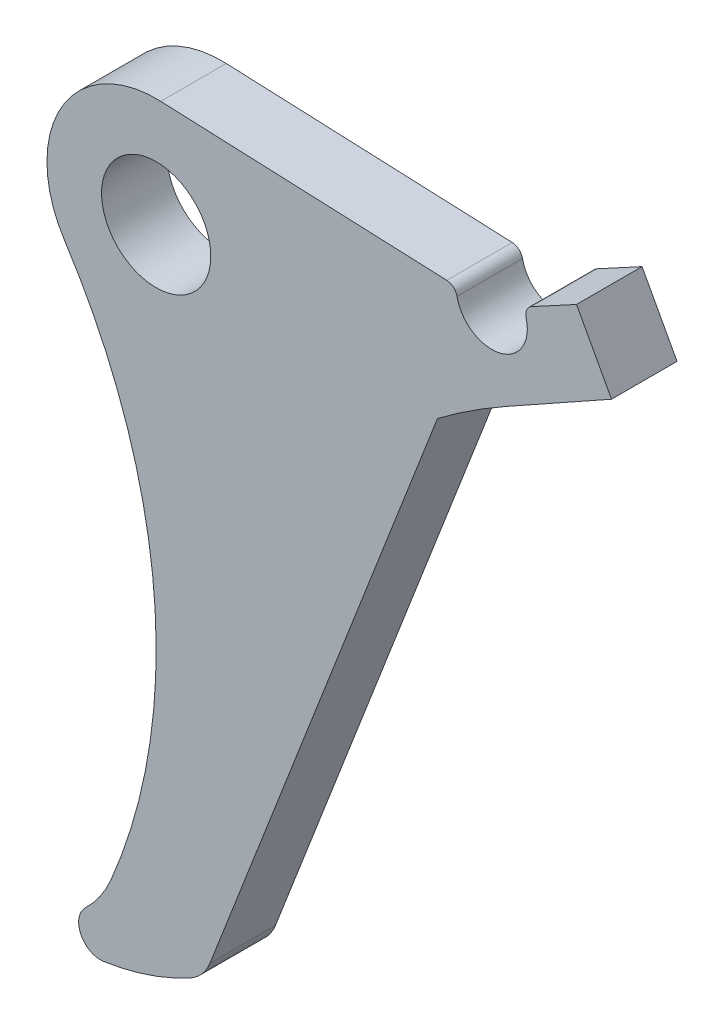
ISO-10303-21;
HEADER;
FILE_DESCRIPTION(('STEP AP214'),'2;1');
FILE_NAME('part.step','',(''),(''),'','','');
FILE_SCHEMA(('AUTOMOTIVE_DESIGN { 1 0 10303 214 1 1 1 1 }'));
ENDSEC;
DATA;
#1=APPLICATION_CONTEXT('core data for automotive mechanical design processes');
#2=APPLICATION_PROTOCOL_DEFINITION('international standard','automotive_design',2000,#1);
#3=PRODUCT_CONTEXT('',#1,'mechanical');
#4=PRODUCT('Part','Part','',(#3));
#5=PRODUCT_RELATED_PRODUCT_CATEGORY('part','',(#4));
#6=PRODUCT_DEFINITION_FORMATION('','',#4);
#7=PRODUCT_DEFINITION_CONTEXT('part definition',#1,'design');
#8=PRODUCT_DEFINITION('design','',#6,#7);
#9=PRODUCT_DEFINITION_SHAPE('','',#8);
#10=(LENGTH_UNIT() NAMED_UNIT(*) SI_UNIT(.MILLI.,.METRE.));
#11=(NAMED_UNIT(*) PLANE_ANGLE_UNIT() SI_UNIT($,.RADIAN.));
#12=(NAMED_UNIT(*) SI_UNIT($,.STERADIAN.) SOLID_ANGLE_UNIT());
#13=UNCERTAINTY_MEASURE_WITH_UNIT(LENGTH_MEASURE(1.E-05),#10,'distance_accuracy_value','');
#14=(GEOMETRIC_REPRESENTATION_CONTEXT(3) GLOBAL_UNCERTAINTY_ASSIGNED_CONTEXT((#13)) GLOBAL_UNIT_ASSIGNED_CONTEXT((#10,
#11,#12)) REPRESENTATION_CONTEXT('',''));
#15=CARTESIAN_POINT('',(0.,0.,0.));
#16=DIRECTION('',(0.,0.,1.));
#17=DIRECTION('',(1.,0.,0.));
#18=AXIS2_PLACEMENT_3D('',#15,#16,#17);
#19=CARTESIAN_POINT('',(-5.09997800634963,-58.8502306487025,3.));
#20=DIRECTION('',(0.,0.,1.));
#21=DIRECTION('',(1.,0.,0.));
#22=AXIS2_PLACEMENT_3D('',#19,#20,#21);
#23=PLANE('',#22);
#24=CARTESIAN_POINT('',(-5.09997800634963,-58.8502306487025,3.));
#25=DIRECTION('',(0.,0.,1.));
#26=DIRECTION('',(1.,0.,0.));
#27=AXIS2_PLACEMENT_3D('',#24,#25,#26);
#28=CIRCLE('',#27,2.);
#29=CARTESIAN_POINT('',(-6.47627281252223,-57.399088820175,3.));
#30=VERTEX_POINT('',#29);
#31=CARTESIAN_POINT('',(-4.8061098376504,-60.8285232204485,3.));
#32=VERTEX_POINT('',#31);
#33=EDGE_CURVE('E224',#30,#32,#28,.T.);
#34=ORIENTED_EDGE('',*,*,#33,.T.);
#35=CARTESIAN_POINT('',(-8.31922159690975,-37.1785888712499,3.));
#36=DIRECTION('',(0.,0.,1.));
#37=DIRECTION('',(1.,0.,0.));
#38=AXIS2_PLACEMENT_3D('',#35,#36,#37);
#39=CIRCLE('',#38,23.9094405822146);
#40=CARTESIAN_POINT('',(3.09796295264736,-58.1859505788943,3.));
#41=VERTEX_POINT('',#40);
#42=EDGE_CURVE('E119',#32,#41,#39,.T.);
#43=ORIENTED_EDGE('',*,*,#42,.T.);
#44=CARTESIAN_POINT('',(1.18789157137882,-54.6714623773977,3.));
#45=DIRECTION('',(0.,0.,1.));
#46=DIRECTION('',(1.,0.,0.));
#47=AXIS2_PLACEMENT_3D('',#44,#45,#46);
#48=CIRCLE('',#47,4.00000000000001);
#49=CARTESIAN_POINT('',(4.91623441296361,-56.1204136034932,3.));
#50=VERTEX_POINT('',#49);
#51=EDGE_CURVE('E219',#41,#50,#48,.T.);
#52=ORIENTED_EDGE('',*,*,#51,.T.);
#53=DIRECTION('',(0.362237806523864,0.932085710396195,0.));
#54=VECTOR('',#53,1.);
#55=CARTESIAN_POINT('',(4.91623441296361,-56.1204136034932,3.));
#56=LINE('',#55,#54);
#57=CARTESIAN_POINT('',(25.7600480741137,-2.48652858702379,3.));
#58=VERTEX_POINT('',#57);
#59=EDGE_CURVE('E217',#50,#58,#56,.T.);
#60=ORIENTED_EDGE('',*,*,#59,.T.);
#61=CARTESIAN_POINT('',(58.6903833292251,-46.1515151172352,3.));
#62=DIRECTION('',(0.,0.,-1.));
#63=DIRECTION('',(1.,0.,0.));
#64=AXIS2_PLACEMENT_3D('',#61,#62,#63);
#65=CIRCLE('',#64,54.6903833292251);
#66=CARTESIAN_POINT('',(31.9920212548681,1.57935006708883,3.));
#67=VERTEX_POINT('',#66);
#68=EDGE_CURVE('E209',#58,#67,#65,.T.);
#69=ORIENTED_EDGE('',*,*,#68,.T.);
#70=DIRECTION('',(0.872746948892164,0.488172882490843,0.));
#71=VECTOR('',#70,1.);
#72=CARTESIAN_POINT('',(31.9920212548681,1.57935006708883,3.));
#73=LINE('',#72,#71);
#74=CARTESIAN_POINT('',(41.6932201112617,7.00573650745857,3.));
#75=VERTEX_POINT('',#74);
#76=EDGE_CURVE('E206',#67,#75,#73,.T.);
#77=ORIENTED_EDGE('',*,*,#76,.T.);
#78=DIRECTION('',(-0.476238263001309,0.879316278055568,0.));
#79=VECTOR('',#78,1.);
#80=CARTESIAN_POINT('',(41.6932201112617,7.00573650745857,3.));
#81=LINE('',#80,#79);
#82=CARTESIAN_POINT('',(38.4898873605694,12.9203024937377,3.));
#83=VERTEX_POINT('',#82);
#84=EDGE_CURVE('E203',#75,#83,#81,.T.);
#85=ORIENTED_EDGE('',*,*,#84,.T.);
#86=DIRECTION('',(-0.879316278055567,-0.47623826300131,0.));
#87=VECTOR('',#86,1.);
#88=CARTESIAN_POINT('',(38.4898873605694,12.9203024937377,3.));
#89=LINE('',#88,#87);
#90=CARTESIAN_POINT('',(34.365244292859,10.6863931495249,3.));
#91=VERTEX_POINT('',#90);
#92=EDGE_CURVE('E201',#83,#91,#89,.T.);
#93=ORIENTED_EDGE('',*,*,#92,.T.);
#94=CARTESIAN_POINT('',(34.8414825558603,9.8070768714693,3.));
#95=DIRECTION('',(0.,0.,1.));
#96=DIRECTION('',(1.,0.,0.));
#97=AXIS2_PLACEMENT_3D('',#94,#95,#96);
#98=CIRCLE('',#97,1.);
#99=CARTESIAN_POINT('',(33.8747977113715,9.55110731969473,3.));
#100=VERTEX_POINT('',#99);
#101=EDGE_CURVE('E193',#91,#100,#98,.T.);
#102=ORIENTED_EDGE('',*,*,#101,.T.);
#103=CARTESIAN_POINT('',(30.7330719667829,8.71920627642735,3.));
#104=DIRECTION('',(0.,0.,-1.));
#105=DIRECTION('',(1.,0.,0.));
#106=AXIS2_PLACEMENT_3D('',#103,#104,#105);
#107=CIRCLE('',#106,3.25);
#108=CARTESIAN_POINT('',(27.5450357775952,8.08760097528636,3.));
#109=VERTEX_POINT('',#108);
#110=EDGE_CURVE('E190',#100,#109,#107,.T.);
#111=ORIENTED_EDGE('',*,*,#110,.T.);
#112=CARTESIAN_POINT('',(26.5641015655374,7.8932608826276,3.));
#113=DIRECTION('',(0.,0.,1.));
#114=DIRECTION('',(1.,0.,0.));
#115=AXIS2_PLACEMENT_3D('',#112,#113,#114);
#116=CIRCLE('',#115,0.999999999999997);
#117=CARTESIAN_POINT('',(26.6060257735832,8.89238167651576,3.));
#118=VERTEX_POINT('',#117);
#119=EDGE_CURVE('E187',#109,#118,#116,.T.);
#120=ORIENTED_EDGE('',*,*,#119,.T.);
#121=DIRECTION('',(-0.999120793888174,0.0419242080457737,0.));
#122=VECTOR('',#121,1.);
#123=CARTESIAN_POINT('',(0.419242080457745,9.99120793888174,3.));
#124=LINE('',#123,#122);
#125=CARTESIAN_POINT('',(0.419242080457738,9.99120793888173,3.));
#126=VERTEX_POINT('',#125);
#127=EDGE_CURVE('E159',#118,#126,#124,.T.);
#128=ORIENTED_EDGE('',*,*,#127,.T.);
#129=CARTESIAN_POINT('',(0.,0.,3.));
#130=DIRECTION('',(0.,0.,1.));
#131=DIRECTION('',(1.,0.,0.));
#132=AXIS2_PLACEMENT_3D('',#129,#130,#131);
#133=CIRCLE('',#132,9.99999999999999);
#134=CARTESIAN_POINT('',(-8.38314883928712,-5.45186349227113,3.));
#135=VERTEX_POINT('',#134);
#136=EDGE_CURVE('E153',#126,#135,#133,.T.);
#137=ORIENTED_EDGE('',*,*,#136,.T.);
#138=CARTESIAN_POINT('',(-51.84861193773,-33.7190189470957,3.));
#139=DIRECTION('',(0.,0.,-1.));
#140=DIRECTION('',(1.,0.,0.));
#141=AXIS2_PLACEMENT_3D('',#138,#139,#140);
#142=CIRCLE('',#141,51.84861193773);
#143=CARTESIAN_POINT('',(-4.16010245039586,-54.0680882807473,3.));
#144=VERTEX_POINT('',#143);
#145=EDGE_CURVE('E157',#135,#144,#142,.T.);
#146=ORIENTED_EDGE('',*,*,#145,.T.);
#147=CARTESIAN_POINT('',(-13.3577468433852,-50.1433796775371,3.));
#148=DIRECTION('',(0.,0.,-1.));
#149=DIRECTION('',(1.,0.,0.));
#150=AXIS2_PLACEMENT_3D('',#147,#148,#149);
#151=CIRCLE('',#150,10.);
#152=EDGE_CURVE('E55',#144,#30,#151,.T.);
#153=ORIENTED_EDGE('',*,*,#152,.T.);
#154=EDGE_LOOP('',(#34,#43,#52,#60,#69,#77,#85,#93,#102,#111,#120,#128,#137,#146,#153));
#155=FACE_BOUND('',#154,.T.);
#156=CARTESIAN_POINT('',(0.,0.,3.));
#157=DIRECTION('',(0.,0.,1.));
#158=DIRECTION('',(1.,0.,0.));
#159=AXIS2_PLACEMENT_3D('',#156,#157,#158);
#160=CIRCLE('',#159,5.);
#161=CARTESIAN_POINT('',(5.,0.,3.));
#162=VERTEX_POINT('',#161);
#163=EDGE_CURVE('E230',#162,#162,#160,.T.);
#164=ORIENTED_EDGE('',*,*,#163,.F.);
#165=EDGE_LOOP('',(#164));
#166=FACE_BOUND('',#165,.T.);
#167=ADVANCED_FACE('F38',(#155,#166),#23,.T.);
#168=CARTESIAN_POINT('',(-5.09997800634963,-58.8502306487025,-3.));
#169=DIRECTION('',(0.,0.,1.));
#170=DIRECTION('',(1.,0.,0.));
#171=AXIS2_PLACEMENT_3D('',#168,#169,#170);
#172=PLANE('',#171);
#173=CARTESIAN_POINT('',(-5.09997800634963,-58.8502306487025,-3.));
#174=DIRECTION('',(0.,0.,1.));
#175=DIRECTION('',(1.,0.,0.));
#176=AXIS2_PLACEMENT_3D('',#173,#174,#175);
#177=CIRCLE('',#176,2.);
#178=CARTESIAN_POINT('',(-6.47627281252223,-57.399088820175,-3.));
#179=VERTEX_POINT('',#178);
#180=CARTESIAN_POINT('',(-4.8061098376504,-60.8285232204485,-3.));
#181=VERTEX_POINT('',#180);
#182=EDGE_CURVE('E233',#179,#181,#177,.T.);
#183=ORIENTED_EDGE('',*,*,#182,.F.);
#184=CARTESIAN_POINT('',(-13.3577468433852,-50.1433796775371,-3.));
#185=DIRECTION('',(0.,0.,-1.));
#186=DIRECTION('',(1.,0.,0.));
#187=AXIS2_PLACEMENT_3D('',#184,#185,#186);
#188=CIRCLE('',#187,10.);
#189=CARTESIAN_POINT('',(-4.16010245039586,-54.0680882807473,-3.));
#190=VERTEX_POINT('',#189);
#191=EDGE_CURVE('E111',#190,#179,#188,.T.);
#192=ORIENTED_EDGE('',*,*,#191,.F.);
#193=CARTESIAN_POINT('',(-51.84861193773,-33.7190189470957,-3.));
#194=DIRECTION('',(0.,0.,-1.));
#195=DIRECTION('',(1.,0.,0.));
#196=AXIS2_PLACEMENT_3D('',#193,#194,#195);
#197=CIRCLE('',#196,51.84861193773);
#198=CARTESIAN_POINT('',(-8.38314883928712,-5.45186349227113,-3.));
#199=VERTEX_POINT('',#198);
#200=EDGE_CURVE('E105',#199,#190,#197,.T.);
#201=ORIENTED_EDGE('',*,*,#200,.F.);
#202=CARTESIAN_POINT('',(0.,0.,-3.));
#203=DIRECTION('',(0.,0.,1.));
#204=DIRECTION('',(1.,0.,0.));
#205=AXIS2_PLACEMENT_3D('',#202,#203,#204);
#206=CIRCLE('',#205,9.99999999999999);
#207=CARTESIAN_POINT('',(0.419242080457738,9.99120793888173,-3.));
#208=VERTEX_POINT('',#207);
#209=EDGE_CURVE('E167',#208,#199,#206,.T.);
#210=ORIENTED_EDGE('',*,*,#209,.F.);
#211=DIRECTION('',(-0.999120793888174,0.0419242080457737,0.));
#212=VECTOR('',#211,1.);
#213=CARTESIAN_POINT('',(0.419242080457745,9.99120793888174,-3.));
#214=LINE('',#213,#212);
#215=CARTESIAN_POINT('',(26.6060257735832,8.89238167651576,-3.));
#216=VERTEX_POINT('',#215);
#217=EDGE_CURVE('E261',#216,#208,#214,.T.);
#218=ORIENTED_EDGE('',*,*,#217,.F.);
#219=CARTESIAN_POINT('',(26.5641015655374,7.8932608826276,-3.));
#220=DIRECTION('',(0.,0.,1.));
#221=DIRECTION('',(1.,0.,0.));
#222=AXIS2_PLACEMENT_3D('',#219,#220,#221);
#223=CIRCLE('',#222,0.999999999999997);
#224=CARTESIAN_POINT('',(27.5450357775952,8.08760097528636,-3.));
#225=VERTEX_POINT('',#224);
#226=EDGE_CURVE('E259',#225,#216,#223,.T.);
#227=ORIENTED_EDGE('',*,*,#226,.F.);
#228=CARTESIAN_POINT('',(30.7330719667829,8.71920627642735,-3.));
#229=DIRECTION('',(0.,0.,-1.));
#230=DIRECTION('',(1.,0.,0.));
#231=AXIS2_PLACEMENT_3D('',#228,#229,#230);
#232=CIRCLE('',#231,3.25);
#233=CARTESIAN_POINT('',(33.8747977113715,9.55110731969473,-3.));
#234=VERTEX_POINT('',#233);
#235=EDGE_CURVE('E257',#234,#225,#232,.T.);
#236=ORIENTED_EDGE('',*,*,#235,.F.);
#237=CARTESIAN_POINT('',(34.8414825558603,9.8070768714693,-3.));
#238=DIRECTION('',(0.,0.,1.));
#239=DIRECTION('',(1.,0.,0.));
#240=AXIS2_PLACEMENT_3D('',#237,#238,#239);
#241=CIRCLE('',#240,1.);
#242=CARTESIAN_POINT('',(34.365244292859,10.6863931495249,-3.));
#243=VERTEX_POINT('',#242);
#244=EDGE_CURVE('E255',#243,#234,#241,.T.);
#245=ORIENTED_EDGE('',*,*,#244,.F.);
#246=DIRECTION('',(-0.879316278055567,-0.47623826300131,0.));
#247=VECTOR('',#246,1.);
#248=CARTESIAN_POINT('',(38.4898873605694,12.9203024937377,-3.));
#249=LINE('',#248,#247);
#250=CARTESIAN_POINT('',(38.4898873605694,12.9203024937377,-3.));
#251=VERTEX_POINT('',#250);
#252=EDGE_CURVE('E253',#251,#243,#249,.T.);
#253=ORIENTED_EDGE('',*,*,#252,.F.);
#254=DIRECTION('',(-0.476238263001309,0.879316278055568,0.));
#255=VECTOR('',#254,1.);
#256=CARTESIAN_POINT('',(41.6932201112617,7.00573650745857,-3.));
#257=LINE('',#256,#255);
#258=CARTESIAN_POINT('',(41.6932201112617,7.00573650745857,-3.));
#259=VERTEX_POINT('',#258);
#260=EDGE_CURVE('E251',#259,#251,#257,.T.);
#261=ORIENTED_EDGE('',*,*,#260,.F.);
#262=DIRECTION('',(0.872746948892164,0.488172882490843,0.));
#263=VECTOR('',#262,1.);
#264=CARTESIAN_POINT('',(31.9920212548681,1.57935006708883,-3.));
#265=LINE('',#264,#263);
#266=CARTESIAN_POINT('',(31.9920212548681,1.57935006708883,-3.));
#267=VERTEX_POINT('',#266);
#268=EDGE_CURVE('E249',#267,#259,#265,.T.);
#269=ORIENTED_EDGE('',*,*,#268,.F.);
#270=CARTESIAN_POINT('',(58.6903833292251,-46.1515151172352,-3.));
#271=DIRECTION('',(0.,0.,-1.));
#272=DIRECTION('',(1.,0.,0.));
#273=AXIS2_PLACEMENT_3D('',#270,#271,#272);
#274=CIRCLE('',#273,54.6903833292251);
#275=CARTESIAN_POINT('',(25.7600480741137,-2.48652858702379,-3.));
#276=VERTEX_POINT('',#275);
#277=EDGE_CURVE('E247',#276,#267,#274,.T.);
#278=ORIENTED_EDGE('',*,*,#277,.F.);
#279=DIRECTION('',(0.362237806523864,0.932085710396195,0.));
#280=VECTOR('',#279,1.);
#281=CARTESIAN_POINT('',(4.91623441296361,-56.1204136034932,-3.));
#282=LINE('',#281,#280);
#283=CARTESIAN_POINT('',(4.91623441296361,-56.1204136034932,-3.));
#284=VERTEX_POINT('',#283);
#285=EDGE_CURVE('E245',#284,#276,#282,.T.);
#286=ORIENTED_EDGE('',*,*,#285,.F.);
#287=CARTESIAN_POINT('',(1.18789157137882,-54.6714623773977,-3.));
#288=DIRECTION('',(0.,0.,1.));
#289=DIRECTION('',(1.,0.,0.));
#290=AXIS2_PLACEMENT_3D('',#287,#288,#289);
#291=CIRCLE('',#290,4.00000000000001);
#292=CARTESIAN_POINT('',(3.09796295264736,-58.1859505788943,-3.));
#293=VERTEX_POINT('',#292);
#294=EDGE_CURVE('E241',#293,#284,#291,.T.);
#295=ORIENTED_EDGE('',*,*,#294,.F.);
#296=CARTESIAN_POINT('',(-8.31922159690975,-37.1785888712499,-3.));
#297=DIRECTION('',(0.,0.,1.));
#298=DIRECTION('',(1.,0.,0.));
#299=AXIS2_PLACEMENT_3D('',#296,#297,#298);
#300=CIRCLE('',#299,23.9094405822146);
#301=EDGE_CURVE('E237',#181,#293,#300,.T.);
#302=ORIENTED_EDGE('',*,*,#301,.F.);
#303=EDGE_LOOP('',(#183,#192,#201,#210,#218,#227,#236,#245,#253,#261,#269,#278,#286,#295,#302));
#304=FACE_BOUND('',#303,.T.);
#305=CARTESIAN_POINT('',(0.,0.,-3.));
#306=DIRECTION('',(0.,0.,1.));
#307=DIRECTION('',(1.,0.,0.));
#308=AXIS2_PLACEMENT_3D('',#305,#306,#307);
#309=CIRCLE('',#308,5.);
#310=CARTESIAN_POINT('',(5.,0.,-3.));
#311=VERTEX_POINT('',#310);
#312=EDGE_CURVE('E228',#311,#311,#309,.T.);
#313=ORIENTED_EDGE('',*,*,#312,.T.);
#314=EDGE_LOOP('',(#313));
#315=FACE_BOUND('',#314,.T.);
#316=ADVANCED_FACE('F303',(#304,#315),#172,.F.);
#317=CARTESIAN_POINT('',(-5.09997800634963,-58.8502306487025,3.));
#318=DIRECTION('',(0.,0.,-1.));
#319=DIRECTION('',(-1.,0.,0.));
#320=AXIS2_PLACEMENT_3D('',#317,#318,#319);
#321=CYLINDRICAL_SURFACE('',#320,2.);
#322=ORIENTED_EDGE('',*,*,#182,.T.);
#323=DIRECTION('',(0.,0.,-1.));
#324=VECTOR('',#323,1.);
#325=CARTESIAN_POINT('',(-4.8061098376504,-60.8285232204485,3.));
#326=LINE('',#325,#324);
#327=EDGE_CURVE('E12',#32,#181,#326,.T.);
#328=ORIENTED_EDGE('',*,*,#327,.F.);
#329=ORIENTED_EDGE('',*,*,#33,.F.);
#330=DIRECTION('',(0.,0.,-1.));
#331=VECTOR('',#330,1.);
#332=CARTESIAN_POINT('',(-6.47627281252223,-57.399088820175,3.));
#333=LINE('',#332,#331);
#334=EDGE_CURVE('E173',#30,#179,#333,.T.);
#335=ORIENTED_EDGE('',*,*,#334,.T.);
#336=EDGE_LOOP('',(#322,#328,#329,#335));
#337=FACE_BOUND('',#336,.T.);
#338=ADVANCED_FACE('F40',(#337),#321,.T.);
#339=CARTESIAN_POINT('',(-8.31922159690975,-37.1785888712499,3.));
#340=DIRECTION('',(0.,0.,-1.));
#341=DIRECTION('',(-1.,0.,0.));
#342=AXIS2_PLACEMENT_3D('',#339,#340,#341);
#343=CYLINDRICAL_SURFACE('',#342,23.9094405822146);
#344=ORIENTED_EDGE('',*,*,#301,.T.);
#345=DIRECTION('',(0.,0.,-1.));
#346=VECTOR('',#345,1.);
#347=CARTESIAN_POINT('',(3.09796295264736,-58.1859505788943,3.));
#348=LINE('',#347,#346);
#349=EDGE_CURVE('E47',#41,#293,#348,.T.);
#350=ORIENTED_EDGE('',*,*,#349,.F.);
#351=ORIENTED_EDGE('',*,*,#42,.F.);
#352=ORIENTED_EDGE('',*,*,#327,.T.);
#353=EDGE_LOOP('',(#344,#350,#351,#352));
#354=FACE_BOUND('',#353,.T.);
#355=ADVANCED_FACE('F318',(#354),#343,.T.);
#356=CARTESIAN_POINT('',(1.18789157137882,-54.6714623773977,3.));
#357=DIRECTION('',(0.,0.,-1.));
#358=DIRECTION('',(-1.,0.,0.));
#359=AXIS2_PLACEMENT_3D('',#356,#357,#358);
#360=CYLINDRICAL_SURFACE('',#359,4.00000000000001);
#361=ORIENTED_EDGE('',*,*,#294,.T.);
#362=DIRECTION('',(0.,0.,-1.));
#363=VECTOR('',#362,1.);
#364=CARTESIAN_POINT('',(4.91623441296361,-56.1204136034932,3.));
#365=LINE('',#364,#363);
#366=EDGE_CURVE('E293',#50,#284,#365,.T.);
#367=ORIENTED_EDGE('',*,*,#366,.F.);
#368=ORIENTED_EDGE('',*,*,#51,.F.);
#369=ORIENTED_EDGE('',*,*,#349,.T.);
#370=EDGE_LOOP('',(#361,#367,#368,#369));
#371=FACE_BOUND('',#370,.T.);
#372=ADVANCED_FACE('F299',(#371),#360,.T.);
#373=CARTESIAN_POINT('',(4.91623441296361,-56.1204136034932,3.));
#374=DIRECTION('',(-0.932085710396195,0.362237806523864,0.));
#375=DIRECTION('',(-0.362237806523864,-0.932085710396195,0.));
#376=AXIS2_PLACEMENT_3D('',#373,#374,#375);
#377=PLANE('',#376);
#378=ORIENTED_EDGE('',*,*,#285,.T.);
#379=DIRECTION('',(0.,0.,-1.));
#380=VECTOR('',#379,1.);
#381=CARTESIAN_POINT('',(25.7600480741137,-2.48652858702379,3.));
#382=LINE('',#381,#380);
#383=EDGE_CURVE('E290',#58,#276,#382,.T.);
#384=ORIENTED_EDGE('',*,*,#383,.F.);
#385=ORIENTED_EDGE('',*,*,#59,.F.);
#386=ORIENTED_EDGE('',*,*,#366,.T.);
#387=EDGE_LOOP('',(#378,#384,#385,#386));
#388=FACE_BOUND('',#387,.T.);
#389=ADVANCED_FACE('F309',(#388),#377,.F.);
#390=CARTESIAN_POINT('',(58.6903833292251,-46.1515151172352,3.));
#391=DIRECTION('',(0.,0.,-1.));
#392=DIRECTION('',(-1.,0.,0.));
#393=AXIS2_PLACEMENT_3D('',#390,#391,#392);
#394=CYLINDRICAL_SURFACE('',#393,54.6903833292251);
#395=ORIENTED_EDGE('',*,*,#277,.T.);
#396=DIRECTION('',(0.,0.,-1.));
#397=VECTOR('',#396,1.);
#398=CARTESIAN_POINT('',(31.9920212548681,1.57935006708883,3.));
#399=LINE('',#398,#397);
#400=EDGE_CURVE('E287',#67,#267,#399,.T.);
#401=ORIENTED_EDGE('',*,*,#400,.F.);
#402=ORIENTED_EDGE('',*,*,#68,.F.);
#403=ORIENTED_EDGE('',*,*,#383,.T.);
#404=EDGE_LOOP('',(#395,#401,#402,#403));
#405=FACE_BOUND('',#404,.T.);
#406=ADVANCED_FACE('F313',(#405),#394,.F.);
#407=CARTESIAN_POINT('',(31.9920212548681,1.57935006708883,3.));
#408=DIRECTION('',(-0.488172882490843,0.872746948892164,0.));
#409=DIRECTION('',(-0.872746948892164,-0.488172882490843,0.));
#410=AXIS2_PLACEMENT_3D('',#407,#408,#409);
#411=PLANE('',#410);
#412=ORIENTED_EDGE('',*,*,#268,.T.);
#413=DIRECTION('',(0.,0.,-1.));
#414=VECTOR('',#413,1.);
#415=CARTESIAN_POINT('',(41.6932201112617,7.00573650745857,3.));
#416=LINE('',#415,#414);
#417=EDGE_CURVE('E284',#75,#259,#416,.T.);
#418=ORIENTED_EDGE('',*,*,#417,.F.);
#419=ORIENTED_EDGE('',*,*,#76,.F.);
#420=ORIENTED_EDGE('',*,*,#400,.T.);
#421=EDGE_LOOP('',(#412,#418,#419,#420));
#422=FACE_BOUND('',#421,.T.);
#423=ADVANCED_FACE('F364',(#422),#411,.F.);
#424=CARTESIAN_POINT('',(41.6932201112617,7.00573650745857,3.));
#425=DIRECTION('',(-0.879316278055567,-0.476238263001309,0.));
#426=DIRECTION('',(0.476238263001309,-0.879316278055568,0.));
#427=AXIS2_PLACEMENT_3D('',#424,#425,#426);
#428=PLANE('',#427);
#429=ORIENTED_EDGE('',*,*,#260,.T.);
#430=DIRECTION('',(0.,0.,-1.));
#431=VECTOR('',#430,1.);
#432=CARTESIAN_POINT('',(38.4898873605694,12.9203024937377,3.));
#433=LINE('',#432,#431);
#434=EDGE_CURVE('E281',#83,#251,#433,.T.);
#435=ORIENTED_EDGE('',*,*,#434,.F.);
#436=ORIENTED_EDGE('',*,*,#84,.F.);
#437=ORIENTED_EDGE('',*,*,#417,.T.);
#438=EDGE_LOOP('',(#429,#435,#436,#437));
#439=FACE_BOUND('',#438,.T.);
#440=ADVANCED_FACE('F360',(#439),#428,.F.);
#441=CARTESIAN_POINT('',(38.4898873605694,12.9203024937377,3.));
#442=DIRECTION('',(0.47623826300131,-0.879316278055567,0.));
#443=DIRECTION('',(0.879316278055567,0.47623826300131,0.));
#444=AXIS2_PLACEMENT_3D('',#441,#442,#443);
#445=PLANE('',#444);
#446=ORIENTED_EDGE('',*,*,#252,.T.);
#447=DIRECTION('',(0.,0.,-1.));
#448=VECTOR('',#447,1.);
#449=CARTESIAN_POINT('',(34.365244292859,10.6863931495249,3.));
#450=LINE('',#449,#448);
#451=EDGE_CURVE('E278',#91,#243,#450,.T.);
#452=ORIENTED_EDGE('',*,*,#451,.F.);
#453=ORIENTED_EDGE('',*,*,#92,.F.);
#454=ORIENTED_EDGE('',*,*,#434,.T.);
#455=EDGE_LOOP('',(#446,#452,#453,#454));
#456=FACE_BOUND('',#455,.T.);
#457=ADVANCED_FACE('F356',(#456),#445,.F.);
#458=CARTESIAN_POINT('',(34.8414825558603,9.8070768714693,3.));
#459=DIRECTION('',(0.,0.,-1.));
#460=DIRECTION('',(-1.,0.,0.));
#461=AXIS2_PLACEMENT_3D('',#458,#459,#460);
#462=CYLINDRICAL_SURFACE('',#461,1.);
#463=ORIENTED_EDGE('',*,*,#244,.T.);
#464=DIRECTION('',(0.,0.,-1.));
#465=VECTOR('',#464,1.);
#466=CARTESIAN_POINT('',(33.8747977113715,9.55110731969473,3.));
#467=LINE('',#466,#465);
#468=EDGE_CURVE('E275',#100,#234,#467,.T.);
#469=ORIENTED_EDGE('',*,*,#468,.F.);
#470=ORIENTED_EDGE('',*,*,#101,.F.);
#471=ORIENTED_EDGE('',*,*,#451,.T.);
#472=EDGE_LOOP('',(#463,#469,#470,#471));
#473=FACE_BOUND('',#472,.T.);
#474=ADVANCED_FACE('F352',(#473),#462,.T.);
#475=CARTESIAN_POINT('',(30.7330719667829,8.71920627642735,3.));
#476=DIRECTION('',(0.,0.,-1.));
#477=DIRECTION('',(-1.,0.,0.));
#478=AXIS2_PLACEMENT_3D('',#475,#476,#477);
#479=CYLINDRICAL_SURFACE('',#478,3.25);
#480=ORIENTED_EDGE('',*,*,#235,.T.);
#481=DIRECTION('',(0.,0.,-1.));
#482=VECTOR('',#481,1.);
#483=CARTESIAN_POINT('',(27.5450357775952,8.08760097528636,3.));
#484=LINE('',#483,#482);
#485=EDGE_CURVE('E272',#109,#225,#484,.T.);
#486=ORIENTED_EDGE('',*,*,#485,.F.);
#487=ORIENTED_EDGE('',*,*,#110,.F.);
#488=ORIENTED_EDGE('',*,*,#468,.T.);
#489=EDGE_LOOP('',(#480,#486,#487,#488));
#490=FACE_BOUND('',#489,.T.);
#491=ADVANCED_FACE('F348',(#490),#479,.F.);
#492=CARTESIAN_POINT('',(26.5641015655374,7.8932608826276,3.));
#493=DIRECTION('',(0.,0.,-1.));
#494=DIRECTION('',(-1.,0.,0.));
#495=AXIS2_PLACEMENT_3D('',#492,#493,#494);
#496=CYLINDRICAL_SURFACE('',#495,0.999999999999997);
#497=ORIENTED_EDGE('',*,*,#226,.T.);
#498=DIRECTION('',(0.,0.,-1.));
#499=VECTOR('',#498,1.);
#500=CARTESIAN_POINT('',(26.6060257735832,8.89238167651576,3.));
#501=LINE('',#500,#499);
#502=EDGE_CURVE('E269',#118,#216,#501,.T.);
#503=ORIENTED_EDGE('',*,*,#502,.F.);
#504=ORIENTED_EDGE('',*,*,#119,.F.);
#505=ORIENTED_EDGE('',*,*,#485,.T.);
#506=EDGE_LOOP('',(#497,#503,#504,#505));
#507=FACE_BOUND('',#506,.T.);
#508=ADVANCED_FACE('F344',(#507),#496,.T.);
#509=CARTESIAN_POINT('',(0.419242080457745,9.99120793888174,3.));
#510=DIRECTION('',(-0.0419242080457737,-0.999120793888174,0.));
#511=DIRECTION('',(0.999120793888174,-0.0419242080457737,0.));
#512=AXIS2_PLACEMENT_3D('',#509,#510,#511);
#513=PLANE('',#512);
#514=ORIENTED_EDGE('',*,*,#217,.T.);
#515=DIRECTION('',(0.,0.,-1.));
#516=VECTOR('',#515,1.);
#517=CARTESIAN_POINT('',(0.419242080457738,9.99120793888173,3.));
#518=LINE('',#517,#516);
#519=EDGE_CURVE('E168',#126,#208,#518,.T.);
#520=ORIENTED_EDGE('',*,*,#519,.F.);
#521=ORIENTED_EDGE('',*,*,#127,.F.);
#522=ORIENTED_EDGE('',*,*,#502,.T.);
#523=EDGE_LOOP('',(#514,#520,#521,#522));
#524=FACE_BOUND('',#523,.T.);
#525=ADVANCED_FACE('F341',(#524),#513,.F.);
#526=CARTESIAN_POINT('',(0.,0.,3.));
#527=DIRECTION('',(0.,0.,-1.));
#528=DIRECTION('',(-1.,0.,0.));
#529=AXIS2_PLACEMENT_3D('',#526,#527,#528);
#530=CYLINDRICAL_SURFACE('',#529,9.99999999999999);
#531=ORIENTED_EDGE('',*,*,#209,.T.);
#532=DIRECTION('',(0.,0.,-1.));
#533=VECTOR('',#532,1.);
#534=CARTESIAN_POINT('',(-8.38314883928712,-5.45186349227113,3.));
#535=LINE('',#534,#533);
#536=EDGE_CURVE('E164',#135,#199,#535,.T.);
#537=ORIENTED_EDGE('',*,*,#536,.F.);
#538=ORIENTED_EDGE('',*,*,#136,.F.);
#539=ORIENTED_EDGE('',*,*,#519,.T.);
#540=EDGE_LOOP('',(#531,#537,#538,#539));
#541=FACE_BOUND('',#540,.T.);
#542=ADVANCED_FACE('F165',(#541),#530,.T.);
#543=CARTESIAN_POINT('',(-51.84861193773,-33.7190189470957,3.));
#544=DIRECTION('',(0.,0.,-1.));
#545=DIRECTION('',(-1.,0.,0.));
#546=AXIS2_PLACEMENT_3D('',#543,#544,#545);
#547=CYLINDRICAL_SURFACE('',#546,51.84861193773);
#548=ORIENTED_EDGE('',*,*,#200,.T.);
#549=DIRECTION('',(0.,0.,-1.));
#550=VECTOR('',#549,1.);
#551=CARTESIAN_POINT('',(-4.16010245039586,-54.0680882807473,3.));
#552=LINE('',#551,#550);
#553=EDGE_CURVE('E169',#144,#190,#552,.T.);
#554=ORIENTED_EDGE('',*,*,#553,.F.);
#555=ORIENTED_EDGE('',*,*,#145,.F.);
#556=ORIENTED_EDGE('',*,*,#536,.T.);
#557=EDGE_LOOP('',(#548,#554,#555,#556));
#558=FACE_BOUND('',#557,.T.);
#559=ADVANCED_FACE('F171',(#558),#547,.F.);
#560=CARTESIAN_POINT('',(-13.3577468433852,-50.1433796775371,3.));
#561=DIRECTION('',(0.,0.,-1.));
#562=DIRECTION('',(-1.,0.,0.));
#563=AXIS2_PLACEMENT_3D('',#560,#561,#562);
#564=CYLINDRICAL_SURFACE('',#563,10.);
#565=ORIENTED_EDGE('',*,*,#191,.T.);
#566=ORIENTED_EDGE('',*,*,#334,.F.);
#567=ORIENTED_EDGE('',*,*,#152,.F.);
#568=ORIENTED_EDGE('',*,*,#553,.T.);
#569=EDGE_LOOP('',(#565,#566,#567,#568));
#570=FACE_BOUND('',#569,.T.);
#571=ADVANCED_FACE('F334',(#570),#564,.F.);
#572=CARTESIAN_POINT('',(0.,0.,3.));
#573=DIRECTION('',(0.,0.,-1.));
#574=DIRECTION('',(-1.,0.,0.));
#575=AXIS2_PLACEMENT_3D('',#572,#573,#574);
#576=CYLINDRICAL_SURFACE('',#575,5.);
#577=ORIENTED_EDGE('',*,*,#163,.T.);
#578=EDGE_LOOP('',(#577));
#579=FACE_BOUND('',#578,.T.);
#580=ORIENTED_EDGE('',*,*,#312,.F.);
#581=EDGE_LOOP('',(#580));
#582=FACE_BOUND('',#581,.T.);
#583=ADVANCED_FACE('F332',(#579,#582),#576,.F.);
#584=CLOSED_SHELL('',(#167,#316,#338,#355,#372,#389,#406,#423,#440,#457,#474,#491,#508,#525,
#542,#559,#571,#583));
#585=MANIFOLD_SOLID_BREP('B2',#584);
#586=ADVANCED_BREP_SHAPE_REPRESENTATION('',(#18,#585),#14);
#587=SHAPE_DEFINITION_REPRESENTATION(#9,#586);
ENDSEC;
END-ISO-10303-21;
